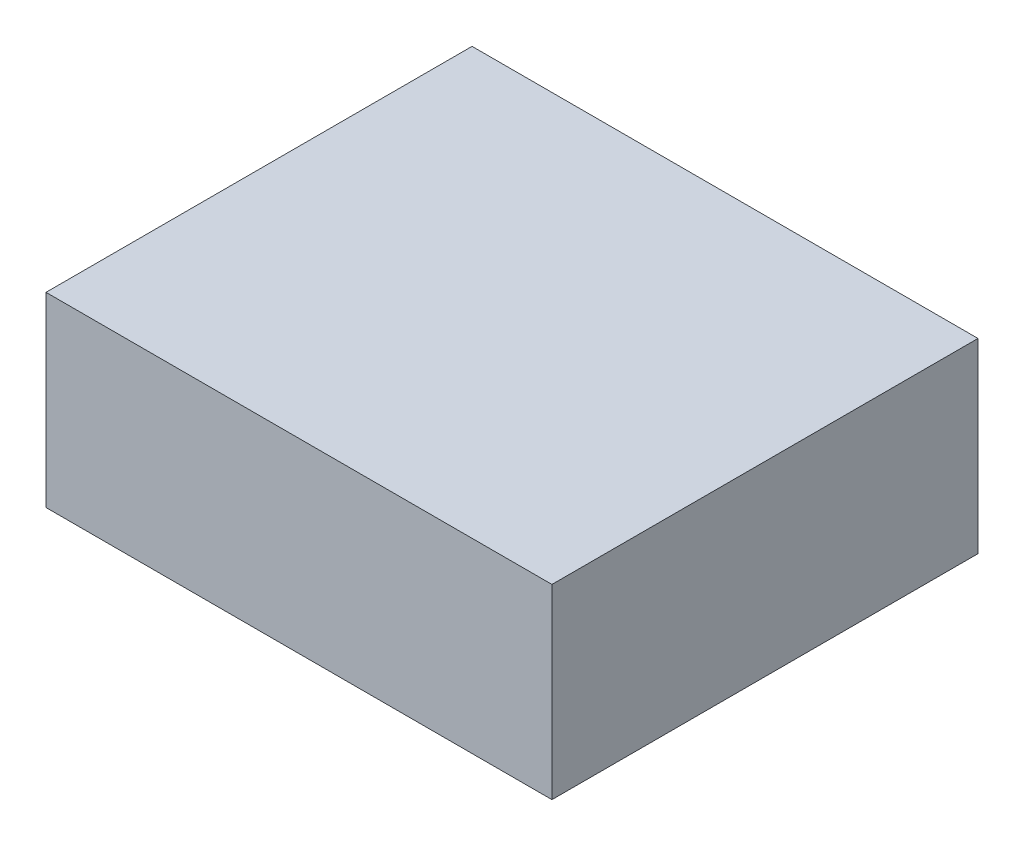
ISO-10303-21;
HEADER;
FILE_DESCRIPTION(('STEP AP214'),'2;1');
FILE_NAME('part.step','',(''),(''),'','','');
FILE_SCHEMA(('AUTOMOTIVE_DESIGN { 1 0 10303 214 1 1 1 1 }'));
ENDSEC;
DATA;
#1=APPLICATION_CONTEXT('core data for automotive mechanical design processes');
#2=APPLICATION_PROTOCOL_DEFINITION('international standard','automotive_design',2000,#1);
#3=PRODUCT_CONTEXT('',#1,'mechanical');
#4=PRODUCT('Part','Part','',(#3));
#5=PRODUCT_RELATED_PRODUCT_CATEGORY('part','',(#4));
#6=PRODUCT_DEFINITION_FORMATION('','',#4);
#7=PRODUCT_DEFINITION_CONTEXT('part definition',#1,'design');
#8=PRODUCT_DEFINITION('design','',#6,#7);
#9=PRODUCT_DEFINITION_SHAPE('','',#8);
#10=(LENGTH_UNIT() NAMED_UNIT(*) SI_UNIT(.MILLI.,.METRE.));
#11=(NAMED_UNIT(*) PLANE_ANGLE_UNIT() SI_UNIT($,.RADIAN.));
#12=(NAMED_UNIT(*) SI_UNIT($,.STERADIAN.) SOLID_ANGLE_UNIT());
#13=UNCERTAINTY_MEASURE_WITH_UNIT(LENGTH_MEASURE(1.E-05),#10,'distance_accuracy_value','');
#14=(GEOMETRIC_REPRESENTATION_CONTEXT(3) GLOBAL_UNCERTAINTY_ASSIGNED_CONTEXT((#13)) GLOBAL_UNIT_ASSIGNED_CONTEXT((#10,
#11,#12)) REPRESENTATION_CONTEXT('',''));
#15=CARTESIAN_POINT('',(0.,0.,0.));
#16=DIRECTION('',(0.,0.,1.));
#17=DIRECTION('',(1.,0.,0.));
#18=AXIS2_PLACEMENT_3D('',#15,#16,#17);
#19=CARTESIAN_POINT('',(-0.47499778,0.17500092,0.));
#20=DIRECTION('',(0.,1.,0.));
#21=DIRECTION('',(0.,0.,1.));
#22=AXIS2_PLACEMENT_3D('',#19,#20,#21);
#23=PLANE('',#22);
#24=DIRECTION('',(0.,0.,-1.));
#25=VECTOR('',#24,1.);
#26=CARTESIAN_POINT('',(0.47500032,0.17500092,0.));
#27=LINE('',#26,#25);
#28=CARTESIAN_POINT('',(0.47500032,0.17500092,0.));
#29=VERTEX_POINT('',#28);
#30=CARTESIAN_POINT('',(0.47500032,0.17500092,0.80000094));
#31=VERTEX_POINT('',#30);
#32=EDGE_CURVE('E19',#29,#31,#27,.F.);
#33=ORIENTED_EDGE('',*,*,#32,.F.);
#34=DIRECTION('',(1.,0.,0.));
#35=VECTOR('',#34,1.);
#36=CARTESIAN_POINT('',(0.47500032,0.17500092,0.));
#37=LINE('',#36,#35);
#38=CARTESIAN_POINT('',(-0.47499778,0.17500092,0.));
#39=VERTEX_POINT('',#38);
#40=EDGE_CURVE('E79',#29,#39,#37,.F.);
#41=ORIENTED_EDGE('',*,*,#40,.T.);
#42=DIRECTION('',(0.,0.,1.));
#43=VECTOR('',#42,1.);
#44=CARTESIAN_POINT('',(-0.47499778,0.17500092,0.));
#45=LINE('',#44,#43);
#46=CARTESIAN_POINT('',(-0.47499778,0.17500092,0.80000094));
#47=VERTEX_POINT('',#46);
#48=EDGE_CURVE('E67',#47,#39,#45,.F.);
#49=ORIENTED_EDGE('',*,*,#48,.F.);
#50=DIRECTION('',(1.,0.,0.));
#51=VECTOR('',#50,1.);
#52=CARTESIAN_POINT('',(0.47500032,0.17500092,0.80000094));
#53=LINE('',#52,#51);
#54=EDGE_CURVE('E55',#31,#47,#53,.F.);
#55=ORIENTED_EDGE('',*,*,#54,.F.);
#56=EDGE_LOOP('',(#33,#41,#49,#55));
#57=FACE_BOUND('',#56,.T.);
#58=ADVANCED_FACE('F16',(#57),#23,.T.);
#59=CARTESIAN_POINT('',(0.47500032,0.17500092,0.));
#60=DIRECTION('',(1.,0.,0.));
#61=DIRECTION('',(0.,0.,-1.));
#62=AXIS2_PLACEMENT_3D('',#59,#60,#61);
#63=PLANE('',#62);
#64=DIRECTION('',(0.,0.,-1.));
#65=VECTOR('',#64,1.);
#66=CARTESIAN_POINT('',(0.47500032,-0.17500092,0.));
#67=LINE('',#66,#65);
#68=CARTESIAN_POINT('',(0.47500032,-0.17500092,0.));
#69=VERTEX_POINT('',#68);
#70=CARTESIAN_POINT('',(0.47500032,-0.17500092,0.80000094));
#71=VERTEX_POINT('',#70);
#72=EDGE_CURVE('E82',#69,#71,#67,.F.);
#73=ORIENTED_EDGE('',*,*,#72,.F.);
#74=DIRECTION('',(0.,1.,0.));
#75=VECTOR('',#74,1.);
#76=CARTESIAN_POINT('',(0.47500032,-0.17500092,0.));
#77=LINE('',#76,#75);
#78=EDGE_CURVE('E64',#69,#29,#77,.T.);
#79=ORIENTED_EDGE('',*,*,#78,.T.);
#80=ORIENTED_EDGE('',*,*,#32,.T.);
#81=DIRECTION('',(0.,1.,0.));
#82=VECTOR('',#81,1.);
#83=CARTESIAN_POINT('',(0.47500032,-0.17500092,0.80000094));
#84=LINE('',#83,#82);
#85=EDGE_CURVE('E61',#71,#31,#84,.T.);
#86=ORIENTED_EDGE('',*,*,#85,.F.);
#87=EDGE_LOOP('',(#73,#79,#80,#86));
#88=FACE_BOUND('',#87,.T.);
#89=ADVANCED_FACE('F60',(#88),#63,.T.);
#90=CARTESIAN_POINT('',(0.47500032,-0.17500092,0.80000094));
#91=DIRECTION('',(0.,0.,1.));
#92=DIRECTION('',(1.,0.,0.));
#93=AXIS2_PLACEMENT_3D('',#90,#91,#92);
#94=PLANE('',#93);
#95=DIRECTION('',(0.,1.,0.));
#96=VECTOR('',#95,1.);
#97=CARTESIAN_POINT('',(-0.47499778,-0.17500092,0.80000094));
#98=LINE('',#97,#96);
#99=CARTESIAN_POINT('',(-0.47499778,-0.17500092,0.80000094));
#100=VERTEX_POINT('',#99);
#101=EDGE_CURVE('E69',#100,#47,#98,.T.);
#102=ORIENTED_EDGE('',*,*,#101,.F.);
#103=DIRECTION('',(1.,0.,0.));
#104=VECTOR('',#103,1.);
#105=CARTESIAN_POINT('',(0.47500032,-0.17500092,0.80000094));
#106=LINE('',#105,#104);
#107=EDGE_CURVE('E73',#71,#100,#106,.F.);
#108=ORIENTED_EDGE('',*,*,#107,.F.);
#109=ORIENTED_EDGE('',*,*,#85,.T.);
#110=ORIENTED_EDGE('',*,*,#54,.T.);
#111=EDGE_LOOP('',(#102,#108,#109,#110));
#112=FACE_BOUND('',#111,.T.);
#113=ADVANCED_FACE('F71',(#112),#94,.T.);
#114=CARTESIAN_POINT('',(-0.47499778,-0.17500092,0.));
#115=DIRECTION('',(-1.,0.,0.));
#116=DIRECTION('',(0.,0.,1.));
#117=AXIS2_PLACEMENT_3D('',#114,#115,#116);
#118=PLANE('',#117);
#119=ORIENTED_EDGE('',*,*,#48,.T.);
#120=DIRECTION('',(0.,1.,0.));
#121=VECTOR('',#120,1.);
#122=CARTESIAN_POINT('',(-0.47499778,-0.17500092,0.));
#123=LINE('',#122,#121);
#124=CARTESIAN_POINT('',(-0.47499778,-0.17500092,0.));
#125=VERTEX_POINT('',#124);
#126=EDGE_CURVE('E34',#39,#125,#123,.F.);
#127=ORIENTED_EDGE('',*,*,#126,.T.);
#128=DIRECTION('',(0.,0.,-1.));
#129=VECTOR('',#128,1.);
#130=CARTESIAN_POINT('',(-0.47499778,-0.17500092,0.));
#131=LINE('',#130,#129);
#132=EDGE_CURVE('E25',#100,#125,#131,.T.);
#133=ORIENTED_EDGE('',*,*,#132,.F.);
#134=ORIENTED_EDGE('',*,*,#101,.T.);
#135=EDGE_LOOP('',(#119,#127,#133,#134));
#136=FACE_BOUND('',#135,.T.);
#137=ADVANCED_FACE('F88',(#136),#118,.T.);
#138=CARTESIAN_POINT('',(0.47500032,-0.17500092,0.));
#139=DIRECTION('',(0.,0.,1.));
#140=DIRECTION('',(1.,0.,0.));
#141=AXIS2_PLACEMENT_3D('',#138,#139,#140);
#142=PLANE('',#141);
#143=ORIENTED_EDGE('',*,*,#126,.F.);
#144=ORIENTED_EDGE('',*,*,#40,.F.);
#145=ORIENTED_EDGE('',*,*,#78,.F.);
#146=DIRECTION('',(1.,0.,0.));
#147=VECTOR('',#146,1.);
#148=CARTESIAN_POINT('',(0.47500032,-0.17500092,0.));
#149=LINE('',#148,#147);
#150=EDGE_CURVE('E11',#125,#69,#149,.T.);
#151=ORIENTED_EDGE('',*,*,#150,.F.);
#152=EDGE_LOOP('',(#143,#144,#145,#151));
#153=FACE_BOUND('',#152,.T.);
#154=ADVANCED_FACE('F90',(#153),#142,.F.);
#155=CARTESIAN_POINT('',(0.47500032,-0.17500092,0.));
#156=DIRECTION('',(0.,-1.,0.));
#157=DIRECTION('',(0.,0.,-1.));
#158=AXIS2_PLACEMENT_3D('',#155,#156,#157);
#159=PLANE('',#158);
#160=ORIENTED_EDGE('',*,*,#132,.T.);
#161=ORIENTED_EDGE('',*,*,#150,.T.);
#162=ORIENTED_EDGE('',*,*,#72,.T.);
#163=ORIENTED_EDGE('',*,*,#107,.T.);
#164=EDGE_LOOP('',(#160,#161,#162,#163));
#165=FACE_BOUND('',#164,.T.);
#166=ADVANCED_FACE('F87',(#165),#159,.T.);
#167=CLOSED_SHELL('',(#58,#89,#113,#137,#154,#166));
#168=MANIFOLD_SOLID_BREP('B1',#167);
#169=ADVANCED_BREP_SHAPE_REPRESENTATION('',(#18,#168),#14);
#170=SHAPE_DEFINITION_REPRESENTATION(#9,#169);
ENDSEC;
END-ISO-10303-21;
